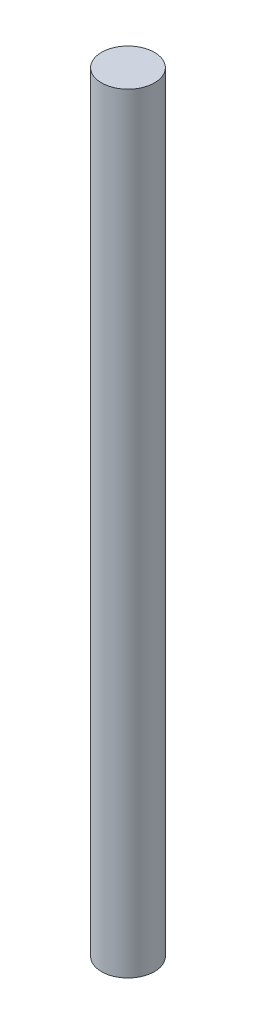
ISO-10303-21;
HEADER;
FILE_DESCRIPTION(('STEP AP214'),'2;1');
FILE_NAME('part.step','',(''),(''),'','','');
FILE_SCHEMA(('AUTOMOTIVE_DESIGN { 1 0 10303 214 1 1 1 1 }'));
ENDSEC;
DATA;
#1=APPLICATION_CONTEXT('core data for automotive mechanical design processes');
#2=APPLICATION_PROTOCOL_DEFINITION('international standard','automotive_design',2000,#1);
#3=PRODUCT_CONTEXT('',#1,'mechanical');
#4=PRODUCT('Part','Part','',(#3));
#5=PRODUCT_RELATED_PRODUCT_CATEGORY('part','',(#4));
#6=PRODUCT_DEFINITION_FORMATION('','',#4);
#7=PRODUCT_DEFINITION_CONTEXT('part definition',#1,'design');
#8=PRODUCT_DEFINITION('design','',#6,#7);
#9=PRODUCT_DEFINITION_SHAPE('','',#8);
#10=(LENGTH_UNIT() NAMED_UNIT(*) SI_UNIT(.MILLI.,.METRE.));
#11=(NAMED_UNIT(*) PLANE_ANGLE_UNIT() SI_UNIT($,.RADIAN.));
#12=(NAMED_UNIT(*) SI_UNIT($,.STERADIAN.) SOLID_ANGLE_UNIT());
#13=UNCERTAINTY_MEASURE_WITH_UNIT(LENGTH_MEASURE(1.E-05),#10,'distance_accuracy_value','');
#14=(GEOMETRIC_REPRESENTATION_CONTEXT(3) GLOBAL_UNCERTAINTY_ASSIGNED_CONTEXT((#13)) GLOBAL_UNIT_ASSIGNED_CONTEXT((#10,
#11,#12)) REPRESENTATION_CONTEXT('',''));
#15=CARTESIAN_POINT('',(0.,0.,0.));
#16=DIRECTION('',(0.,0.,1.));
#17=DIRECTION('',(1.,0.,0.));
#18=AXIS2_PLACEMENT_3D('',#15,#16,#17);
#19=CARTESIAN_POINT('',(0.,320.,0.));
#20=DIRECTION('',(0.,-1.,0.));
#21=DIRECTION('',(0.,0.,-1.));
#22=AXIS2_PLACEMENT_3D('',#19,#20,#21);
#23=CYLINDRICAL_SURFACE('',#22,11.);
#24=CARTESIAN_POINT('',(0.,320.,0.));
#25=DIRECTION('',(0.,1.,0.));
#26=DIRECTION('',(0.,0.,1.));
#27=AXIS2_PLACEMENT_3D('',#24,#25,#26);
#28=CIRCLE('',#27,11.);
#29=CARTESIAN_POINT('',(0.,320.,11.));
#30=VERTEX_POINT('',#29);
#31=EDGE_CURVE('E10',#30,#30,#28,.T.);
#32=ORIENTED_EDGE('',*,*,#31,.F.);
#33=EDGE_LOOP('',(#32));
#34=FACE_BOUND('',#33,.T.);
#35=CARTESIAN_POINT('',(0.,0.,0.));
#36=DIRECTION('',(0.,1.,0.));
#37=DIRECTION('',(0.,0.,1.));
#38=AXIS2_PLACEMENT_3D('',#35,#36,#37);
#39=CIRCLE('',#38,11.);
#40=CARTESIAN_POINT('',(0.,0.,11.));
#41=VERTEX_POINT('',#40);
#42=EDGE_CURVE('E34',#41,#41,#39,.T.);
#43=ORIENTED_EDGE('',*,*,#42,.T.);
#44=EDGE_LOOP('',(#43));
#45=FACE_BOUND('',#44,.T.);
#46=ADVANCED_FACE('F31',(#34,#45),#23,.T.);
#47=CARTESIAN_POINT('',(0.,320.,0.));
#48=DIRECTION('',(0.,1.,0.));
#49=DIRECTION('',(0.,0.,1.));
#50=AXIS2_PLACEMENT_3D('',#47,#48,#49);
#51=PLANE('',#50);
#52=ORIENTED_EDGE('',*,*,#31,.T.);
#53=EDGE_LOOP('',(#52));
#54=FACE_BOUND('',#53,.T.);
#55=ADVANCED_FACE('F46',(#54),#51,.T.);
#56=CARTESIAN_POINT('',(0.,0.,0.));
#57=DIRECTION('',(0.,1.,0.));
#58=DIRECTION('',(0.,0.,1.));
#59=AXIS2_PLACEMENT_3D('',#56,#57,#58);
#60=PLANE('',#59);
#61=ORIENTED_EDGE('',*,*,#42,.F.);
#62=EDGE_LOOP('',(#61));
#63=FACE_BOUND('',#62,.T.);
#64=ADVANCED_FACE('F44',(#63),#60,.F.);
#65=CLOSED_SHELL('',(#46,#55,#64));
#66=MANIFOLD_SOLID_BREP('B2',#65);
#67=ADVANCED_BREP_SHAPE_REPRESENTATION('',(#18,#66),#14);
#68=SHAPE_DEFINITION_REPRESENTATION(#9,#67);
ENDSEC;
END-ISO-10303-21;
